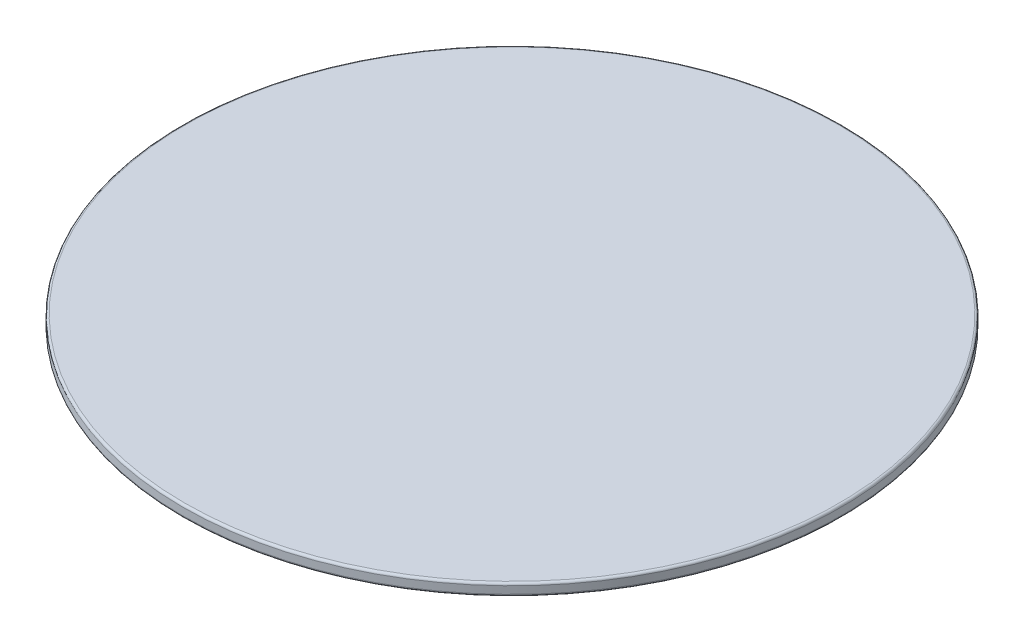
ISO-10303-21;
HEADER;
FILE_DESCRIPTION(('STEP AP214'),'2;1');
FILE_NAME('part.step','',(''),(''),'','','');
FILE_SCHEMA(('AUTOMOTIVE_DESIGN { 1 0 10303 214 1 1 1 1 }'));
ENDSEC;
DATA;
#1=APPLICATION_CONTEXT('core data for automotive mechanical design processes');
#2=APPLICATION_PROTOCOL_DEFINITION('international standard','automotive_design',2000,#1);
#3=PRODUCT_CONTEXT('',#1,'mechanical');
#4=PRODUCT('Part','Part','',(#3));
#5=PRODUCT_RELATED_PRODUCT_CATEGORY('part','',(#4));
#6=PRODUCT_DEFINITION_FORMATION('','',#4);
#7=PRODUCT_DEFINITION_CONTEXT('part definition',#1,'design');
#8=PRODUCT_DEFINITION('design','',#6,#7);
#9=PRODUCT_DEFINITION_SHAPE('','',#8);
#10=(LENGTH_UNIT() NAMED_UNIT(*) SI_UNIT(.MILLI.,.METRE.));
#11=(NAMED_UNIT(*) PLANE_ANGLE_UNIT() SI_UNIT($,.RADIAN.));
#12=(NAMED_UNIT(*) SI_UNIT($,.STERADIAN.) SOLID_ANGLE_UNIT());
#13=UNCERTAINTY_MEASURE_WITH_UNIT(LENGTH_MEASURE(1.E-05),#10,'distance_accuracy_value','');
#14=(GEOMETRIC_REPRESENTATION_CONTEXT(3) GLOBAL_UNCERTAINTY_ASSIGNED_CONTEXT((#13)) GLOBAL_UNIT_ASSIGNED_CONTEXT((#10,
#11,#12)) REPRESENTATION_CONTEXT('',''));
#15=CARTESIAN_POINT('',(0.,0.,0.));
#16=DIRECTION('',(0.,0.,1.));
#17=DIRECTION('',(1.,0.,0.));
#18=AXIS2_PLACEMENT_3D('',#15,#16,#17);
#19=CARTESIAN_POINT('',(0.,5.25,0.));
#20=DIRECTION('',(0.,-1.,0.));
#21=DIRECTION('',(0.,0.,-1.));
#22=AXIS2_PLACEMENT_3D('',#19,#20,#21);
#23=CYLINDRICAL_SURFACE('',#22,145.);
#24=CARTESIAN_POINT('',(0.,4.25,0.));
#25=DIRECTION('',(0.,1.,0.));
#26=DIRECTION('',(0.,0.,1.));
#27=AXIS2_PLACEMENT_3D('',#24,#25,#26);
#28=CIRCLE('',#27,145.);
#29=CARTESIAN_POINT('',(0.,4.25,145.));
#30=VERTEX_POINT('',#29);
#31=EDGE_CURVE('E39',#30,#30,#28,.F.);
#32=ORIENTED_EDGE('',*,*,#31,.T.);
#33=EDGE_LOOP('',(#32));
#34=FACE_BOUND('',#33,.T.);
#35=CARTESIAN_POINT('',(0.,1.,0.));
#36=DIRECTION('',(0.,1.,0.));
#37=DIRECTION('',(0.,0.,1.));
#38=AXIS2_PLACEMENT_3D('',#35,#36,#37);
#39=CIRCLE('',#38,145.);
#40=CARTESIAN_POINT('',(0.,1.,145.));
#41=VERTEX_POINT('',#40);
#42=EDGE_CURVE('E43',#41,#41,#39,.T.);
#43=ORIENTED_EDGE('',*,*,#42,.T.);
#44=EDGE_LOOP('',(#43));
#45=FACE_BOUND('',#44,.T.);
#46=ADVANCED_FACE('F32',(#34,#45),#23,.T.);
#47=CARTESIAN_POINT('',(0.,5.25,0.));
#48=DIRECTION('',(0.,1.,0.));
#49=DIRECTION('',(0.,0.,1.));
#50=AXIS2_PLACEMENT_3D('',#47,#48,#49);
#51=PLANE('',#50);
#52=CARTESIAN_POINT('',(0.,5.25,0.));
#53=DIRECTION('',(0.,1.,0.));
#54=DIRECTION('',(0.,0.,1.));
#55=AXIS2_PLACEMENT_3D('',#52,#53,#54);
#56=CIRCLE('',#55,144.);
#57=CARTESIAN_POINT('',(0.,5.25,144.));
#58=VERTEX_POINT('',#57);
#59=EDGE_CURVE('E47',#58,#58,#56,.T.);
#60=ORIENTED_EDGE('',*,*,#59,.T.);
#61=EDGE_LOOP('',(#60));
#62=FACE_BOUND('',#61,.T.);
#63=ADVANCED_FACE('F53',(#62),#51,.T.);
#64=CARTESIAN_POINT('',(0.,0.,0.));
#65=DIRECTION('',(0.,1.,0.));
#66=DIRECTION('',(0.,0.,1.));
#67=AXIS2_PLACEMENT_3D('',#64,#65,#66);
#68=PLANE('',#67);
#69=CARTESIAN_POINT('',(0.,0.,0.));
#70=DIRECTION('',(0.,1.,0.));
#71=DIRECTION('',(0.,0.,1.));
#72=AXIS2_PLACEMENT_3D('',#69,#70,#71);
#73=CIRCLE('',#72,144.);
#74=CARTESIAN_POINT('',(0.,0.,144.));
#75=VERTEX_POINT('',#74);
#76=EDGE_CURVE('E10',#75,#75,#73,.F.);
#77=ORIENTED_EDGE('',*,*,#76,.T.);
#78=EDGE_LOOP('',(#77));
#79=FACE_BOUND('',#78,.T.);
#80=ADVANCED_FACE('F57',(#79),#68,.F.);
#81=CARTESIAN_POINT('',(0.,4.25,0.));
#82=DIRECTION('',(0.,1.,0.));
#83=DIRECTION('',(0.,0.,1.));
#84=AXIS2_PLACEMENT_3D('',#81,#82,#83);
#85=TOROIDAL_SURFACE('',#84,144.,1.);
#86=ORIENTED_EDGE('',*,*,#31,.F.);
#87=EDGE_LOOP('',(#86));
#88=FACE_BOUND('',#87,.T.);
#89=ORIENTED_EDGE('',*,*,#59,.F.);
#90=EDGE_LOOP('',(#89));
#91=FACE_BOUND('',#90,.T.);
#92=ADVANCED_FACE('F55',(#88,#91),#85,.T.);
#93=CARTESIAN_POINT('',(0.,1.,0.));
#94=DIRECTION('',(0.,1.,0.));
#95=DIRECTION('',(0.,0.,1.));
#96=AXIS2_PLACEMENT_3D('',#93,#94,#95);
#97=TOROIDAL_SURFACE('',#96,144.,1.);
#98=ORIENTED_EDGE('',*,*,#76,.F.);
#99=EDGE_LOOP('',(#98));
#100=FACE_BOUND('',#99,.T.);
#101=ORIENTED_EDGE('',*,*,#42,.F.);
#102=EDGE_LOOP('',(#101));
#103=FACE_BOUND('',#102,.T.);
#104=ADVANCED_FACE('F34',(#100,#103),#97,.T.);
#105=CLOSED_SHELL('',(#46,#63,#80,#92,#104));
#106=MANIFOLD_SOLID_BREP('B2',#105);
#107=ADVANCED_BREP_SHAPE_REPRESENTATION('',(#18,#106),#14);
#108=SHAPE_DEFINITION_REPRESENTATION(#9,#107);
ENDSEC;
END-ISO-10303-21;
